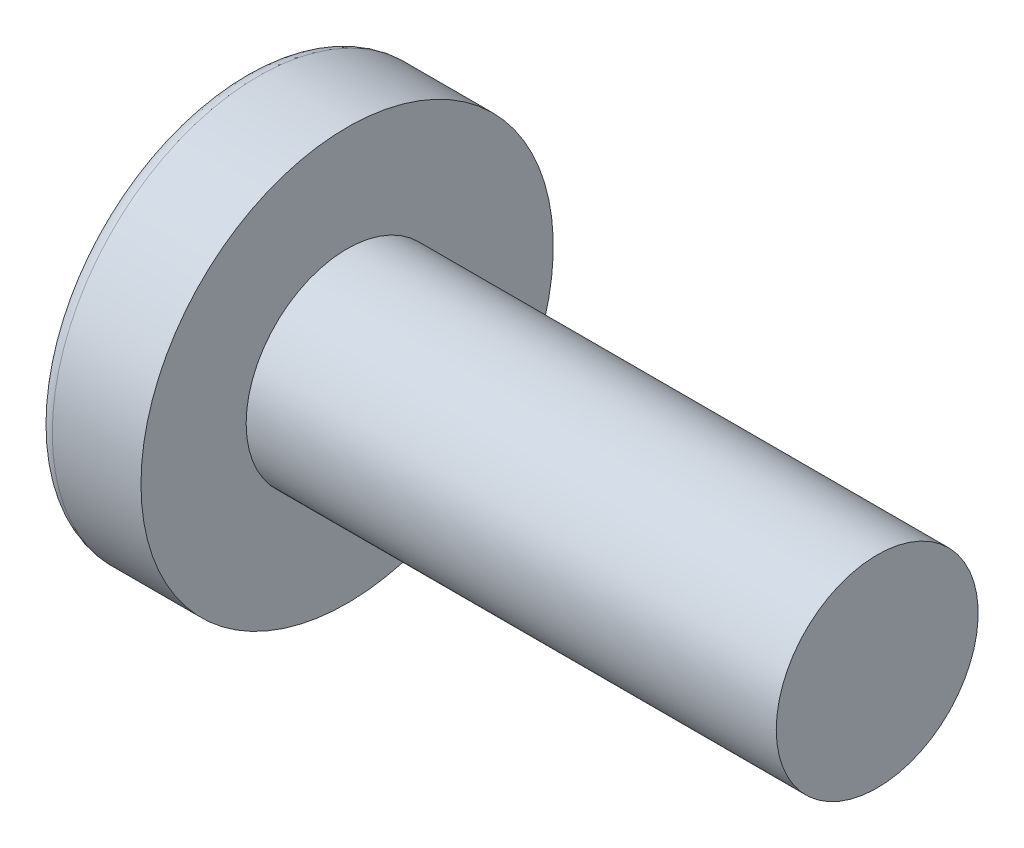
ISO-10303-21;
HEADER;
FILE_DESCRIPTION(('STEP AP214'),'2;1');
FILE_NAME('part.step','',(''),(''),'','','');
FILE_SCHEMA(('AUTOMOTIVE_DESIGN { 1 0 10303 214 1 1 1 1 }'));
ENDSEC;
DATA;
#1=APPLICATION_CONTEXT('core data for automotive mechanical design processes');
#2=APPLICATION_PROTOCOL_DEFINITION('international standard','automotive_design',2000,#1);
#3=PRODUCT_CONTEXT('',#1,'mechanical');
#4=PRODUCT('Part','Part','',(#3));
#5=PRODUCT_RELATED_PRODUCT_CATEGORY('part','',(#4));
#6=PRODUCT_DEFINITION_FORMATION('','',#4);
#7=PRODUCT_DEFINITION_CONTEXT('part definition',#1,'design');
#8=PRODUCT_DEFINITION('design','',#6,#7);
#9=PRODUCT_DEFINITION_SHAPE('','',#8);
#10=(LENGTH_UNIT() NAMED_UNIT(*) SI_UNIT(.MILLI.,.METRE.));
#11=(NAMED_UNIT(*) PLANE_ANGLE_UNIT() SI_UNIT($,.RADIAN.));
#12=(NAMED_UNIT(*) SI_UNIT($,.STERADIAN.) SOLID_ANGLE_UNIT());
#13=UNCERTAINTY_MEASURE_WITH_UNIT(LENGTH_MEASURE(1.E-05),#10,'distance_accuracy_value','');
#14=(GEOMETRIC_REPRESENTATION_CONTEXT(3) GLOBAL_UNCERTAINTY_ASSIGNED_CONTEXT((#13)) GLOBAL_UNIT_ASSIGNED_CONTEXT((#10,
#11,#12)) REPRESENTATION_CONTEXT('',''));
#15=CARTESIAN_POINT('',(0.,0.,0.));
#16=DIRECTION('',(0.,0.,1.));
#17=DIRECTION('',(1.,0.,0.));
#18=AXIS2_PLACEMENT_3D('',#15,#16,#17);
#19=CARTESIAN_POINT('',(-25.4,0.,0.));
#20=DIRECTION('',(-1.,0.,0.));
#21=DIRECTION('',(0.,0.,1.));
#22=AXIS2_PLACEMENT_3D('',#19,#20,#21);
#23=CYLINDRICAL_SURFACE('',#22,2.4);
#24=CARTESIAN_POINT('',(15.6,0.,0.));
#25=DIRECTION('',(-1.,0.,0.));
#26=DIRECTION('',(0.,0.,1.));
#27=AXIS2_PLACEMENT_3D('',#24,#25,#26);
#28=CIRCLE('',#27,2.4);
#29=CARTESIAN_POINT('',(15.6,0.,2.4));
#30=VERTEX_POINT('',#29);
#31=EDGE_CURVE('E77',#30,#30,#28,.T.);
#32=ORIENTED_EDGE('',*,*,#31,.T.);
#33=EDGE_LOOP('',(#32));
#34=FACE_BOUND('',#33,.T.);
#35=CARTESIAN_POINT('',(3.,0.,0.));
#36=DIRECTION('',(-1.,0.,0.));
#37=DIRECTION('',(0.,0.,1.));
#38=AXIS2_PLACEMENT_3D('',#35,#36,#37);
#39=CIRCLE('',#38,2.4);
#40=CARTESIAN_POINT('',(3.,0.,2.4));
#41=VERTEX_POINT('',#40);
#42=EDGE_CURVE('E104',#41,#41,#39,.T.);
#43=ORIENTED_EDGE('',*,*,#42,.F.);
#44=EDGE_LOOP('',(#43));
#45=FACE_BOUND('',#44,.T.);
#46=ADVANCED_FACE('F33',(#34,#45),#23,.T.);
#47=CARTESIAN_POINT('',(3.,2.4,0.));
#48=DIRECTION('',(-1.,0.,0.));
#49=DIRECTION('',(0.,0.,1.));
#50=AXIS2_PLACEMENT_3D('',#47,#48,#49);
#51=PLANE('',#50);
#52=CARTESIAN_POINT('',(3.,0.,0.));
#53=DIRECTION('',(-1.,0.,0.));
#54=DIRECTION('',(0.,0.,1.));
#55=AXIS2_PLACEMENT_3D('',#52,#53,#54);
#56=CIRCLE('',#55,4.9);
#57=CARTESIAN_POINT('',(3.,0.,4.9));
#58=VERTEX_POINT('',#57);
#59=EDGE_CURVE('E101',#58,#58,#56,.T.);
#60=ORIENTED_EDGE('',*,*,#59,.F.);
#61=EDGE_LOOP('',(#60));
#62=FACE_BOUND('',#61,.T.);
#63=ORIENTED_EDGE('',*,*,#42,.T.);
#64=EDGE_LOOP('',(#63));
#65=FACE_BOUND('',#64,.T.);
#66=ADVANCED_FACE('F134',(#62,#65),#51,.F.);
#67=CARTESIAN_POINT('',(-25.4,0.,0.));
#68=DIRECTION('',(-1.,0.,0.));
#69=DIRECTION('',(0.,0.,1.));
#70=AXIS2_PLACEMENT_3D('',#67,#68,#69);
#71=CYLINDRICAL_SURFACE('',#70,4.9);
#72=ORIENTED_EDGE('',*,*,#59,.T.);
#73=EDGE_LOOP('',(#72));
#74=FACE_BOUND('',#73,.T.);
#75=CARTESIAN_POINT('',(0.891938873867921,0.,0.));
#76=DIRECTION('',(-1.,0.,0.));
#77=DIRECTION('',(0.,0.,1.));
#78=AXIS2_PLACEMENT_3D('',#75,#76,#77);
#79=CIRCLE('',#78,4.9);
#80=CARTESIAN_POINT('',(0.891938873867921,0.,4.9));
#81=VERTEX_POINT('',#80);
#82=EDGE_CURVE('E98',#81,#81,#79,.T.);
#83=ORIENTED_EDGE('',*,*,#82,.F.);
#84=EDGE_LOOP('',(#83));
#85=FACE_BOUND('',#84,.T.);
#86=ADVANCED_FACE('F139',(#74,#85),#71,.T.);
#87=CARTESIAN_POINT('',(0.891938873867921,0.,0.));
#88=DIRECTION('',(-1.,0.,0.));
#89=DIRECTION('',(0.,0.,1.));
#90=AXIS2_PLACEMENT_3D('',#87,#88,#89);
#91=TOROIDAL_SURFACE('',#90,4.54,0.360000000000001);
#92=ORIENTED_EDGE('',*,*,#82,.T.);
#93=EDGE_LOOP('',(#92));
#94=FACE_BOUND('',#93,.T.);
#95=CARTESIAN_POINT('',(0.541689280924563,0.,0.));
#96=DIRECTION('',(-1.,0.,0.));
#97=DIRECTION('',(0.,0.,1.));
#98=AXIS2_PLACEMENT_3D('',#95,#96,#97);
#99=CIRCLE('',#98,4.62321792260693);
#100=CARTESIAN_POINT('',(0.541689280924563,0.,4.62321792260693));
#101=VERTEX_POINT('',#100);
#102=EDGE_CURVE('E95',#101,#101,#99,.T.);
#103=ORIENTED_EDGE('',*,*,#102,.F.);
#104=EDGE_LOOP('',(#103));
#105=FACE_BOUND('',#104,.T.);
#106=ADVANCED_FACE('F154',(#94,#105),#91,.T.);
#107=CARTESIAN_POINT('',(20.,0.,0.));
#108=DIRECTION('',(-1.,0.,0.));
#109=DIRECTION('',(0.,1.,0.));
#110=AXIS2_PLACEMENT_3D('',#107,#108,#109);
#111=SPHERICAL_SURFACE('',#110,20.);
#112=CARTESIAN_POINT('',(19.8199043688584,0.,1.71334222059023));
#113=DIRECTION('',(-0.104537710696287,0.,0.994520923380891));
#114=DIRECTION('',(0.994520923380891,0.,0.104537710696287));
#115=AXIS2_PLACEMENT_3D('',#112,#113,#114);
#116=CIRCLE('',#115,19.9256624481794);
#117=CARTESIAN_POINT('',(0.0532165895360693,1.41175057627095,-0.364406210758993));
#118=VERTEX_POINT('',#117);
#119=CARTESIAN_POINT('',(0.0532165895360693,-1.41175057627096,-0.364406210758993));
#120=VERTEX_POINT('',#119);
#121=EDGE_CURVE('E40',#118,#120,#116,.T.);
#122=ORIENTED_EDGE('',*,*,#121,.F.);
#123=CARTESIAN_POINT('',(13.8745653573728,-8.52234385061172,0.));
#124=DIRECTION('',(0.583636048152575,0.812015371342713,0.));
#125=DIRECTION('',(-0.812015371342714,0.583636048152575,0.));
#126=AXIS2_PLACEMENT_3D('',#123,#124,#125);
#127=CIRCLE('',#126,17.0249436337053);
#128=CARTESIAN_POINT('',(0.053216589536071,1.41175057627095,0.364406210758993));
#129=VERTEX_POINT('',#128);
#130=EDGE_CURVE('E11',#118,#129,#127,.T.);
#131=ORIENTED_EDGE('',*,*,#130,.T.);
#132=CARTESIAN_POINT('',(19.8199043688584,0.,-1.71334222059023));
#133=DIRECTION('',(-0.104537710696287,0.,-0.994520923380891));
#134=DIRECTION('',(-0.994520923380891,0.,0.104537710696287));
#135=AXIS2_PLACEMENT_3D('',#132,#133,#134);
#136=CIRCLE('',#135,19.9256624481794);
#137=CARTESIAN_POINT('',(0.0532165895360693,-1.41175057627096,0.364406210758993));
#138=VERTEX_POINT('',#137);
#139=EDGE_CURVE('E110',#138,#129,#136,.T.);
#140=ORIENTED_EDGE('',*,*,#139,.F.);
#141=CARTESIAN_POINT('',(13.8745653573728,8.52234385061172,0.));
#142=DIRECTION('',(0.583636048152575,-0.812015371342713,0.));
#143=DIRECTION('',(0.812015371342714,0.583636048152575,0.));
#144=AXIS2_PLACEMENT_3D('',#141,#142,#143);
#145=CIRCLE('',#144,17.0249436337053);
#146=EDGE_CURVE('E107',#138,#120,#145,.T.);
#147=ORIENTED_EDGE('',*,*,#146,.T.);
#148=EDGE_LOOP('',(#122,#131,#140,#147));
#149=FACE_BOUND('',#148,.T.);
#150=ORIENTED_EDGE('',*,*,#102,.T.);
#151=EDGE_LOOP('',(#150));
#152=FACE_BOUND('',#151,.T.);
#153=ADVANCED_FACE('F113',(#149,#152),#111,.T.);
#154=CARTESIAN_POINT('',(15.6,2.4,0.));
#155=DIRECTION('',(1.,0.,0.));
#156=DIRECTION('',(0.,0.,-1.));
#157=AXIS2_PLACEMENT_3D('',#154,#155,#156);
#158=PLANE('',#157);
#159=ORIENTED_EDGE('',*,*,#31,.F.);
#160=EDGE_LOOP('',(#159));
#161=FACE_BOUND('',#160,.T.);
#162=ADVANCED_FACE('F146',(#161),#158,.T.);
#163=CARTESIAN_POINT('',(1.76,0.185,0.185));
#164=DIRECTION('',(0.583636048152575,0.812015371342713,0.));
#165=DIRECTION('',(-0.812015371342714,0.583636048152575,0.));
#166=AXIS2_PLACEMENT_3D('',#163,#164,#165);
#167=PLANE('',#166);
#168=DIRECTION('',(0.80907355338853,-0.581521616498006,0.0850446632823171));
#169=VECTOR('',#168,1.);
#170=CARTESIAN_POINT('',(0.,1.45,-0.37));
#171=LINE('',#170,#169);
#172=CARTESIAN_POINT('',(1.76,0.185,-0.185));
#173=VERTEX_POINT('',#172);
#174=EDGE_CURVE('E70',#118,#173,#171,.T.);
#175=ORIENTED_EDGE('',*,*,#174,.T.);
#176=DIRECTION('',(0.,0.,-1.));
#177=VECTOR('',#176,1.);
#178=CARTESIAN_POINT('',(1.76,0.185,0.185));
#179=LINE('',#178,#177);
#180=CARTESIAN_POINT('',(1.76,0.185,0.185));
#181=VERTEX_POINT('',#180);
#182=EDGE_CURVE('E73',#181,#173,#179,.T.);
#183=ORIENTED_EDGE('',*,*,#182,.F.);
#184=DIRECTION('',(0.80907355338853,-0.581521616498006,-0.085044663282317));
#185=VECTOR('',#184,1.);
#186=CARTESIAN_POINT('',(0.,1.45,0.37));
#187=LINE('',#186,#185);
#188=EDGE_CURVE('E78',#129,#181,#187,.T.);
#189=ORIENTED_EDGE('',*,*,#188,.F.);
#190=ORIENTED_EDGE('',*,*,#130,.F.);
#191=EDGE_LOOP('',(#175,#183,#189,#190));
#192=FACE_BOUND('',#191,.T.);
#193=ADVANCED_FACE('F72',(#192),#167,.F.);
#194=CARTESIAN_POINT('',(2.01739130434783,0.,-0.15794466403162));
#195=DIRECTION('',(-0.104537710696287,0.,0.994520923380891));
#196=DIRECTION('',(0.994520923380891,0.,0.104537710696287));
#197=AXIS2_PLACEMENT_3D('',#194,#195,#196);
#198=PLANE('',#197);
#199=ORIENTED_EDGE('',*,*,#121,.T.);
#200=DIRECTION('',(0.80907355338853,0.581521616498006,0.0850446632823171));
#201=VECTOR('',#200,1.);
#202=CARTESIAN_POINT('',(0.,-1.45,-0.37));
#203=LINE('',#202,#201);
#204=CARTESIAN_POINT('',(1.76,-0.185,-0.185));
#205=VERTEX_POINT('',#204);
#206=EDGE_CURVE('E47',#120,#205,#203,.T.);
#207=ORIENTED_EDGE('',*,*,#206,.T.);
#208=DIRECTION('',(0.,1.,0.));
#209=VECTOR('',#208,1.);
#210=CARTESIAN_POINT('',(1.76,-0.185,-0.185));
#211=LINE('',#210,#209);
#212=EDGE_CURVE('E85',#205,#173,#211,.T.);
#213=ORIENTED_EDGE('',*,*,#212,.T.);
#214=ORIENTED_EDGE('',*,*,#174,.F.);
#215=EDGE_LOOP('',(#199,#207,#213,#214));
#216=FACE_BOUND('',#215,.T.);
#217=ADVANCED_FACE('F89',(#216),#198,.T.);
#218=CARTESIAN_POINT('',(2.01739130434783,0.,0.157944664031621));
#219=DIRECTION('',(-0.104537710696287,0.,-0.994520923380891));
#220=DIRECTION('',(-0.994520923380891,0.,0.104537710696287));
#221=AXIS2_PLACEMENT_3D('',#218,#219,#220);
#222=PLANE('',#221);
#223=ORIENTED_EDGE('',*,*,#139,.T.);
#224=ORIENTED_EDGE('',*,*,#188,.T.);
#225=DIRECTION('',(0.,-1.,0.));
#226=VECTOR('',#225,1.);
#227=CARTESIAN_POINT('',(1.76,0.185,0.185));
#228=LINE('',#227,#226);
#229=CARTESIAN_POINT('',(1.76,-0.185,0.185));
#230=VERTEX_POINT('',#229);
#231=EDGE_CURVE('E87',#181,#230,#228,.T.);
#232=ORIENTED_EDGE('',*,*,#231,.T.);
#233=DIRECTION('',(0.80907355338853,0.581521616498006,-0.0850446632823168));
#234=VECTOR('',#233,1.);
#235=CARTESIAN_POINT('',(0.,-1.45,0.369999999999999));
#236=LINE('',#235,#234);
#237=EDGE_CURVE('E117',#138,#230,#236,.T.);
#238=ORIENTED_EDGE('',*,*,#237,.F.);
#239=EDGE_LOOP('',(#223,#224,#232,#238));
#240=FACE_BOUND('',#239,.T.);
#241=ADVANCED_FACE('F119',(#240),#222,.T.);
#242=CARTESIAN_POINT('',(1.76,-0.185,-0.185));
#243=DIRECTION('',(0.583636048152575,-0.812015371342713,0.));
#244=DIRECTION('',(0.812015371342714,0.583636048152575,0.));
#245=AXIS2_PLACEMENT_3D('',#242,#243,#244);
#246=PLANE('',#245);
#247=ORIENTED_EDGE('',*,*,#237,.T.);
#248=DIRECTION('',(0.,0.,1.));
#249=VECTOR('',#248,1.);
#250=CARTESIAN_POINT('',(1.76,-0.185,-0.185));
#251=LINE('',#250,#249);
#252=EDGE_CURVE('E120',#205,#230,#251,.T.);
#253=ORIENTED_EDGE('',*,*,#252,.F.);
#254=ORIENTED_EDGE('',*,*,#206,.F.);
#255=ORIENTED_EDGE('',*,*,#146,.F.);
#256=EDGE_LOOP('',(#247,#253,#254,#255));
#257=FACE_BOUND('',#256,.T.);
#258=ADVANCED_FACE('F116',(#257),#246,.F.);
#259=CARTESIAN_POINT('',(1.76,0.185,-0.185));
#260=DIRECTION('',(-1.,0.,0.));
#261=DIRECTION('',(0.,0.,1.));
#262=AXIS2_PLACEMENT_3D('',#259,#260,#261);
#263=PLANE('',#262);
#264=ORIENTED_EDGE('',*,*,#212,.F.);
#265=ORIENTED_EDGE('',*,*,#252,.T.);
#266=ORIENTED_EDGE('',*,*,#231,.F.);
#267=ORIENTED_EDGE('',*,*,#182,.T.);
#268=EDGE_LOOP('',(#264,#265,#266,#267));
#269=FACE_BOUND('',#268,.T.);
#270=ADVANCED_FACE('F83',(#269),#263,.T.);
#271=CLOSED_SHELL('',(#46,#66,#86,#106,#153,#162,#193,#217,#241,#258,#270));
#272=MANIFOLD_SOLID_BREP('B2',#271);
#273=ADVANCED_BREP_SHAPE_REPRESENTATION('',(#18,#272),#14);
#274=SHAPE_DEFINITION_REPRESENTATION(#9,#273);
ENDSEC;
END-ISO-10303-21;
